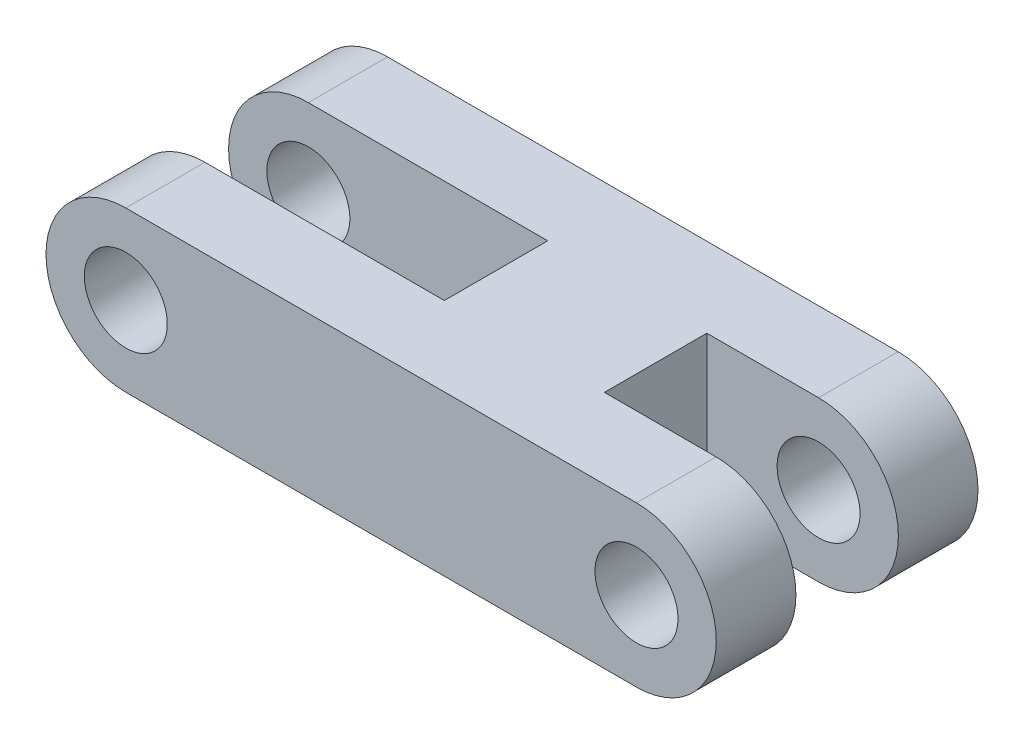
ISO-10303-21;
HEADER;
FILE_DESCRIPTION(('STEP AP214'),'2;1');
FILE_NAME('part.step','',(''),(''),'','','');
FILE_SCHEMA(('AUTOMOTIVE_DESIGN { 1 0 10303 214 1 1 1 1 }'));
ENDSEC;
DATA;
#1=APPLICATION_CONTEXT('core data for automotive mechanical design processes');
#2=APPLICATION_PROTOCOL_DEFINITION('international standard','automotive_design',2000,#1);
#3=PRODUCT_CONTEXT('',#1,'mechanical');
#4=PRODUCT('Part','Part','',(#3));
#5=PRODUCT_RELATED_PRODUCT_CATEGORY('part','',(#4));
#6=PRODUCT_DEFINITION_FORMATION('','',#4);
#7=PRODUCT_DEFINITION_CONTEXT('part definition',#1,'design');
#8=PRODUCT_DEFINITION('design','',#6,#7);
#9=PRODUCT_DEFINITION_SHAPE('','',#8);
#10=(LENGTH_UNIT() NAMED_UNIT(*) SI_UNIT(.MILLI.,.METRE.));
#11=(NAMED_UNIT(*) PLANE_ANGLE_UNIT() SI_UNIT($,.RADIAN.));
#12=(NAMED_UNIT(*) SI_UNIT($,.STERADIAN.) SOLID_ANGLE_UNIT());
#13=UNCERTAINTY_MEASURE_WITH_UNIT(LENGTH_MEASURE(1.E-05),#10,'distance_accuracy_value','');
#14=(GEOMETRIC_REPRESENTATION_CONTEXT(3) GLOBAL_UNCERTAINTY_ASSIGNED_CONTEXT((#13)) GLOBAL_UNIT_ASSIGNED_CONTEXT((#10,
#11,#12)) REPRESENTATION_CONTEXT('',''));
#15=CARTESIAN_POINT('',(0.,0.,0.));
#16=DIRECTION('',(0.,0.,1.));
#17=DIRECTION('',(1.,0.,0.));
#18=AXIS2_PLACEMENT_3D('',#15,#16,#17);
#19=CARTESIAN_POINT('',(-50.8588966961585,0.,10.414));
#20=DIRECTION('',(0.,0.,-1.));
#21=DIRECTION('',(-1.,0.,0.));
#22=AXIS2_PLACEMENT_3D('',#19,#20,#21);
#23=CYLINDRICAL_SURFACE('',#22,3.175);
#24=DIRECTION('',(0.,0.,-1.));
#25=VECTOR('',#24,1.);
#26=CARTESIAN_POINT('',(-50.8588966961585,3.17499999999999,10.414));
#27=LINE('',#26,#25);
#28=CARTESIAN_POINT('',(-50.8588966961585,3.17499999999999,3.16865));
#29=VERTEX_POINT('',#28);
#30=CARTESIAN_POINT('',(-50.8588966961585,3.17499999999999,0.));
#31=VERTEX_POINT('',#30);
#32=EDGE_CURVE('E223',#29,#31,#27,.T.);
#33=ORIENTED_EDGE('',*,*,#32,.F.);
#34=CARTESIAN_POINT('',(-50.8588966961585,0.,3.16865));
#35=DIRECTION('',(0.,0.,-1.));
#36=DIRECTION('',(-1.,0.,0.));
#37=AXIS2_PLACEMENT_3D('',#34,#35,#36);
#38=CIRCLE('',#37,3.175);
#39=CARTESIAN_POINT('',(-50.8588966961585,-3.17500000000001,3.16865));
#40=VERTEX_POINT('',#39);
#41=EDGE_CURVE('E156',#29,#40,#38,.T.);
#42=ORIENTED_EDGE('',*,*,#41,.T.);
#43=DIRECTION('',(0.,0.,-1.));
#44=VECTOR('',#43,1.);
#45=CARTESIAN_POINT('',(-50.8588966961586,-3.17500000000001,10.414));
#46=LINE('',#45,#44);
#47=CARTESIAN_POINT('',(-50.8588966961586,-3.17500000000001,0.));
#48=VERTEX_POINT('',#47);
#49=EDGE_CURVE('E227',#40,#48,#46,.T.);
#50=ORIENTED_EDGE('',*,*,#49,.T.);
#51=CARTESIAN_POINT('',(-50.8588966961585,0.,0.));
#52=DIRECTION('',(0.,0.,1.));
#53=DIRECTION('',(-1.,0.,0.));
#54=AXIS2_PLACEMENT_3D('',#51,#52,#53);
#55=CIRCLE('',#54,3.175);
#56=EDGE_CURVE('E215',#48,#31,#55,.T.);
#57=ORIENTED_EDGE('',*,*,#56,.T.);
#58=EDGE_LOOP('',(#33,#42,#50,#57));
#59=FACE_BOUND('',#58,.T.);
#60=ADVANCED_FACE('F33',(#59),#23,.T.);
#61=CARTESIAN_POINT('',(-50.8588966961585,0.,10.414));
#62=DIRECTION('',(0.,0.,-1.));
#63=DIRECTION('',(-1.,0.,0.));
#64=AXIS2_PLACEMENT_3D('',#61,#62,#63);
#65=CYLINDRICAL_SURFACE('',#64,1.651);
#66=CARTESIAN_POINT('',(-50.8588966961585,0.,3.16865));
#67=DIRECTION('',(0.,0.,-1.));
#68=DIRECTION('',(-1.,0.,0.));
#69=AXIS2_PLACEMENT_3D('',#66,#67,#68);
#70=CIRCLE('',#69,1.651);
#71=CARTESIAN_POINT('',(-52.5098966961585,0.,3.16865));
#72=VERTEX_POINT('',#71);
#73=EDGE_CURVE('E37',#72,#72,#70,.T.);
#74=ORIENTED_EDGE('',*,*,#73,.F.);
#75=EDGE_LOOP('',(#74));
#76=FACE_BOUND('',#75,.T.);
#77=CARTESIAN_POINT('',(-50.8588966961585,0.,0.));
#78=DIRECTION('',(0.,0.,1.));
#79=DIRECTION('',(1.,0.,0.));
#80=AXIS2_PLACEMENT_3D('',#77,#78,#79);
#81=CIRCLE('',#80,1.651);
#82=CARTESIAN_POINT('',(-49.2078966961585,0.,0.));
#83=VERTEX_POINT('',#82);
#84=EDGE_CURVE('E190',#83,#83,#81,.T.);
#85=ORIENTED_EDGE('',*,*,#84,.F.);
#86=EDGE_LOOP('',(#85));
#87=FACE_BOUND('',#86,.T.);
#88=ADVANCED_FACE('F243',(#76,#87),#65,.F.);
#89=CARTESIAN_POINT('',(-71.1788966961585,0.,10.414));
#90=DIRECTION('',(0.,0.,-1.));
#91=DIRECTION('',(-1.,0.,0.));
#92=AXIS2_PLACEMENT_3D('',#89,#90,#91);
#93=CYLINDRICAL_SURFACE('',#92,3.175);
#94=CARTESIAN_POINT('',(-71.1788966961585,0.,3.14960000000001));
#95=DIRECTION('',(0.,0.,-1.));
#96=DIRECTION('',(-1.,0.,0.));
#97=AXIS2_PLACEMENT_3D('',#94,#95,#96);
#98=CIRCLE('',#97,3.175);
#99=CARTESIAN_POINT('',(-71.1788966961585,-3.17500000000001,3.14960000000001));
#100=VERTEX_POINT('',#99);
#101=CARTESIAN_POINT('',(-71.1788966961585,3.17499999999999,3.14960000000001));
#102=VERTEX_POINT('',#101);
#103=EDGE_CURVE('E184',#100,#102,#98,.T.);
#104=ORIENTED_EDGE('',*,*,#103,.T.);
#105=DIRECTION('',(0.,0.,-1.));
#106=VECTOR('',#105,1.);
#107=CARTESIAN_POINT('',(-71.1788966961585,3.17499999999999,10.414));
#108=LINE('',#107,#106);
#109=CARTESIAN_POINT('',(-71.1788966961585,3.17499999999999,0.));
#110=VERTEX_POINT('',#109);
#111=EDGE_CURVE('E209',#102,#110,#108,.T.);
#112=ORIENTED_EDGE('',*,*,#111,.T.);
#113=CARTESIAN_POINT('',(-71.1788966961585,0.,0.));
#114=DIRECTION('',(0.,0.,1.));
#115=DIRECTION('',(1.,0.,0.));
#116=AXIS2_PLACEMENT_3D('',#113,#114,#115);
#117=CIRCLE('',#116,3.175);
#118=CARTESIAN_POINT('',(-71.1788966961585,-3.17500000000001,0.));
#119=VERTEX_POINT('',#118);
#120=EDGE_CURVE('E196',#110,#119,#117,.T.);
#121=ORIENTED_EDGE('',*,*,#120,.T.);
#122=DIRECTION('',(0.,0.,-1.));
#123=VECTOR('',#122,1.);
#124=CARTESIAN_POINT('',(-71.1788966961585,-3.17500000000001,10.414));
#125=LINE('',#124,#123);
#126=EDGE_CURVE('E42',#100,#119,#125,.T.);
#127=ORIENTED_EDGE('',*,*,#126,.F.);
#128=EDGE_LOOP('',(#104,#112,#121,#127));
#129=FACE_BOUND('',#128,.T.);
#130=ADVANCED_FACE('F270',(#129),#93,.T.);
#131=CARTESIAN_POINT('',(-71.1788966961585,0.,10.414));
#132=DIRECTION('',(0.,0.,-1.));
#133=DIRECTION('',(-1.,0.,0.));
#134=AXIS2_PLACEMENT_3D('',#131,#132,#133);
#135=CYLINDRICAL_SURFACE('',#134,1.65099999999999);
#136=CARTESIAN_POINT('',(-71.1788966961585,0.,3.14960000000001));
#137=DIRECTION('',(0.,0.,-1.));
#138=DIRECTION('',(-1.,0.,0.));
#139=AXIS2_PLACEMENT_3D('',#136,#137,#138);
#140=CIRCLE('',#139,1.65099999999999);
#141=CARTESIAN_POINT('',(-72.8298966961585,0.,3.14960000000001));
#142=VERTEX_POINT('',#141);
#143=EDGE_CURVE('E183',#142,#142,#140,.T.);
#144=ORIENTED_EDGE('',*,*,#143,.F.);
#145=EDGE_LOOP('',(#144));
#146=FACE_BOUND('',#145,.T.);
#147=CARTESIAN_POINT('',(-71.1788966961585,0.,0.));
#148=DIRECTION('',(0.,0.,1.));
#149=DIRECTION('',(-1.,0.,0.));
#150=AXIS2_PLACEMENT_3D('',#147,#148,#149);
#151=CIRCLE('',#150,1.65099999999999);
#152=CARTESIAN_POINT('',(-72.8298966961585,0.,0.));
#153=VERTEX_POINT('',#152);
#154=EDGE_CURVE('E186',#153,#153,#151,.T.);
#155=ORIENTED_EDGE('',*,*,#154,.F.);
#156=EDGE_LOOP('',(#155));
#157=FACE_BOUND('',#156,.T.);
#158=ADVANCED_FACE('F250',(#146,#157),#135,.F.);
#159=CARTESIAN_POINT('',(-71.1788966961585,0.,10.414));
#160=DIRECTION('',(0.,0.,1.));
#161=DIRECTION('',(1.,0.,0.));
#162=AXIS2_PLACEMENT_3D('',#159,#160,#161);
#163=PLANE('',#162);
#164=CARTESIAN_POINT('',(-50.8588966961585,0.,10.414));
#165=DIRECTION('',(0.,0.,1.));
#166=DIRECTION('',(1.,0.,0.));
#167=AXIS2_PLACEMENT_3D('',#164,#165,#166);
#168=CIRCLE('',#167,1.651);
#169=CARTESIAN_POINT('',(-49.2078966961585,0.,10.414));
#170=VERTEX_POINT('',#169);
#171=EDGE_CURVE('E193',#170,#170,#168,.T.);
#172=ORIENTED_EDGE('',*,*,#171,.F.);
#173=EDGE_LOOP('',(#172));
#174=FACE_BOUND('',#173,.T.);
#175=CARTESIAN_POINT('',(-71.1788966961585,0.,10.414));
#176=DIRECTION('',(0.,0.,1.));
#177=DIRECTION('',(1.,0.,0.));
#178=AXIS2_PLACEMENT_3D('',#175,#176,#177);
#179=CIRCLE('',#178,3.175);
#180=CARTESIAN_POINT('',(-71.1788966961585,3.17499999999999,10.414));
#181=VERTEX_POINT('',#180);
#182=CARTESIAN_POINT('',(-71.1788966961585,-3.17500000000001,10.414));
#183=VERTEX_POINT('',#182);
#184=EDGE_CURVE('E199',#181,#183,#179,.T.);
#185=ORIENTED_EDGE('',*,*,#184,.T.);
#186=DIRECTION('',(1.,0.,0.));
#187=VECTOR('',#186,1.);
#188=CARTESIAN_POINT('',(-71.1788966961585,-3.17500000000001,10.414));
#189=LINE('',#188,#187);
#190=CARTESIAN_POINT('',(-50.8588966961586,-3.17500000000001,10.414));
#191=VERTEX_POINT('',#190);
#192=EDGE_CURVE('E202',#183,#191,#189,.T.);
#193=ORIENTED_EDGE('',*,*,#192,.T.);
#194=CARTESIAN_POINT('',(-50.8588966961585,0.,10.414));
#195=DIRECTION('',(0.,0.,1.));
#196=DIRECTION('',(-1.,0.,0.));
#197=AXIS2_PLACEMENT_3D('',#194,#195,#196);
#198=CIRCLE('',#197,3.175);
#199=CARTESIAN_POINT('',(-50.8588966961585,3.17499999999999,10.414));
#200=VERTEX_POINT('',#199);
#201=EDGE_CURVE('E205',#191,#200,#198,.T.);
#202=ORIENTED_EDGE('',*,*,#201,.T.);
#203=DIRECTION('',(-1.,0.,0.));
#204=VECTOR('',#203,1.);
#205=CARTESIAN_POINT('',(-71.1788966961585,3.17499999999999,10.414));
#206=LINE('',#205,#204);
#207=EDGE_CURVE('E207',#200,#181,#206,.T.);
#208=ORIENTED_EDGE('',*,*,#207,.T.);
#209=EDGE_LOOP('',(#185,#193,#202,#208));
#210=FACE_BOUND('',#209,.T.);
#211=CARTESIAN_POINT('',(-71.1788966961585,0.,10.414));
#212=DIRECTION('',(0.,0.,1.));
#213=DIRECTION('',(-1.,0.,0.));
#214=AXIS2_PLACEMENT_3D('',#211,#212,#213);
#215=CIRCLE('',#214,1.65099999999999);
#216=CARTESIAN_POINT('',(-72.8298966961585,0.,10.414));
#217=VERTEX_POINT('',#216);
#218=EDGE_CURVE('E187',#217,#217,#215,.T.);
#219=ORIENTED_EDGE('',*,*,#218,.F.);
#220=EDGE_LOOP('',(#219));
#221=FACE_BOUND('',#220,.T.);
#222=ADVANCED_FACE('F246',(#174,#210,#221),#163,.T.);
#223=CARTESIAN_POINT('',(-71.1788966961585,0.,0.));
#224=DIRECTION('',(0.,0.,1.));
#225=DIRECTION('',(1.,0.,0.));
#226=AXIS2_PLACEMENT_3D('',#223,#224,#225);
#227=PLANE('',#226);
#228=ORIENTED_EDGE('',*,*,#84,.T.);
#229=EDGE_LOOP('',(#228));
#230=FACE_BOUND('',#229,.T.);
#231=ORIENTED_EDGE('',*,*,#120,.F.);
#232=DIRECTION('',(-1.,0.,0.));
#233=VECTOR('',#232,1.);
#234=CARTESIAN_POINT('',(-71.1788966961585,3.17499999999999,0.));
#235=LINE('',#234,#233);
#236=EDGE_CURVE('E203',#31,#110,#235,.T.);
#237=ORIENTED_EDGE('',*,*,#236,.F.);
#238=ORIENTED_EDGE('',*,*,#56,.F.);
#239=DIRECTION('',(1.,0.,0.));
#240=VECTOR('',#239,1.);
#241=CARTESIAN_POINT('',(-71.1788966961585,-3.17500000000001,0.));
#242=LINE('',#241,#240);
#243=EDGE_CURVE('E212',#119,#48,#242,.T.);
#244=ORIENTED_EDGE('',*,*,#243,.F.);
#245=EDGE_LOOP('',(#231,#237,#238,#244));
#246=FACE_BOUND('',#245,.T.);
#247=ORIENTED_EDGE('',*,*,#154,.T.);
#248=EDGE_LOOP('',(#247));
#249=FACE_BOUND('',#248,.T.);
#250=ADVANCED_FACE('F249',(#230,#246,#249),#227,.F.);
#251=CARTESIAN_POINT('',(-71.1788966961585,3.17499999999999,7.26440000000001));
#252=VERTEX_POINT('',#251);
#253=EDGE_CURVE('E220',#181,#252,#108,.T.);
#254=ORIENTED_EDGE('',*,*,#253,.T.);
#255=CARTESIAN_POINT('',(-71.1788966961585,0.,7.26440000000001));
#256=DIRECTION('',(0.,0.,1.));
#257=DIRECTION('',(1.,0.,0.));
#258=AXIS2_PLACEMENT_3D('',#255,#256,#257);
#259=CIRCLE('',#258,3.175);
#260=CARTESIAN_POINT('',(-71.1788966961585,-3.17500000000001,7.26440000000001));
#261=VERTEX_POINT('',#260);
#262=EDGE_CURVE('E58',#252,#261,#259,.T.);
#263=ORIENTED_EDGE('',*,*,#262,.T.);
#264=EDGE_CURVE('E11',#183,#261,#125,.T.);
#265=ORIENTED_EDGE('',*,*,#264,.F.);
#266=ORIENTED_EDGE('',*,*,#184,.F.);
#267=EDGE_LOOP('',(#254,#263,#265,#266));
#268=FACE_BOUND('',#267,.T.);
#269=ADVANCED_FACE('F35',(#268),#93,.T.);
#270=CARTESIAN_POINT('',(-71.1788966961585,-3.17500000000001,10.414));
#271=DIRECTION('',(0.,1.,0.));
#272=DIRECTION('',(-1.,0.,0.));
#273=AXIS2_PLACEMENT_3D('',#270,#271,#272);
#274=PLANE('',#273);
#275=ORIENTED_EDGE('',*,*,#49,.F.);
#276=DIRECTION('',(-1.,0.,0.));
#277=VECTOR('',#276,1.);
#278=CARTESIAN_POINT('',(-55.3038966961586,-3.17500000000001,3.16865));
#279=LINE('',#278,#277);
#280=CARTESIAN_POINT('',(-55.3038966961586,-3.17500000000001,3.16865));
#281=VERTEX_POINT('',#280);
#282=EDGE_CURVE('E132',#40,#281,#279,.T.);
#283=ORIENTED_EDGE('',*,*,#282,.T.);
#284=DIRECTION('',(0.,0.,1.));
#285=VECTOR('',#284,1.);
#286=CARTESIAN_POINT('',(-55.3038966961586,-3.17500000000001,7.24535));
#287=LINE('',#286,#285);
#288=CARTESIAN_POINT('',(-55.3038966961586,-3.17500000000001,7.24535));
#289=VERTEX_POINT('',#288);
#290=EDGE_CURVE('E127',#281,#289,#287,.T.);
#291=ORIENTED_EDGE('',*,*,#290,.T.);
#292=DIRECTION('',(1.,0.,0.));
#293=VECTOR('',#292,1.);
#294=CARTESIAN_POINT('',(-55.3038966961586,-3.17500000000001,7.24535));
#295=LINE('',#294,#293);
#296=CARTESIAN_POINT('',(-50.8588966961585,-3.17500000000001,7.24535));
#297=VERTEX_POINT('',#296);
#298=EDGE_CURVE('E135',#289,#297,#295,.T.);
#299=ORIENTED_EDGE('',*,*,#298,.T.);
#300=EDGE_CURVE('E228',#191,#297,#46,.T.);
#301=ORIENTED_EDGE('',*,*,#300,.F.);
#302=ORIENTED_EDGE('',*,*,#192,.F.);
#303=ORIENTED_EDGE('',*,*,#264,.T.);
#304=DIRECTION('',(1.,0.,0.));
#305=VECTOR('',#304,1.);
#306=CARTESIAN_POINT('',(-61.6538966961585,-3.17500000000001,7.26440000000001));
#307=LINE('',#306,#305);
#308=CARTESIAN_POINT('',(-61.6538966961585,-3.17500000000001,7.26440000000001));
#309=VERTEX_POINT('',#308);
#310=EDGE_CURVE('E160',#261,#309,#307,.T.);
#311=ORIENTED_EDGE('',*,*,#310,.T.);
#312=DIRECTION('',(0.,0.,-1.));
#313=VECTOR('',#312,1.);
#314=CARTESIAN_POINT('',(-61.6538966961585,-3.17500000000001,7.26440000000001));
#315=LINE('',#314,#313);
#316=CARTESIAN_POINT('',(-61.6538966961585,-3.17500000000001,3.1496));
#317=VERTEX_POINT('',#316);
#318=EDGE_CURVE('E163',#309,#317,#315,.T.);
#319=ORIENTED_EDGE('',*,*,#318,.T.);
#320=DIRECTION('',(-1.,0.,0.));
#321=VECTOR('',#320,1.);
#322=CARTESIAN_POINT('',(-61.6538966961585,-3.17500000000001,3.1496));
#323=LINE('',#322,#321);
#324=EDGE_CURVE('E167',#317,#100,#323,.T.);
#325=ORIENTED_EDGE('',*,*,#324,.T.);
#326=ORIENTED_EDGE('',*,*,#126,.T.);
#327=ORIENTED_EDGE('',*,*,#243,.T.);
#328=EDGE_LOOP('',(#275,#283,#291,#299,#301,#302,#303,#311,#319,#325,#326,#327));
#329=FACE_BOUND('',#328,.T.);
#330=ADVANCED_FACE('F144',(#329),#274,.F.);
#331=ORIENTED_EDGE('',*,*,#300,.T.);
#332=CARTESIAN_POINT('',(-50.8588966961585,0.,7.24535));
#333=DIRECTION('',(0.,0.,1.));
#334=DIRECTION('',(1.,0.,0.));
#335=AXIS2_PLACEMENT_3D('',#332,#333,#334);
#336=CIRCLE('',#335,3.175);
#337=CARTESIAN_POINT('',(-50.8588966961585,3.17499999999999,7.24535));
#338=VERTEX_POINT('',#337);
#339=EDGE_CURVE('E138',#297,#338,#336,.T.);
#340=ORIENTED_EDGE('',*,*,#339,.T.);
#341=EDGE_CURVE('E224',#200,#338,#27,.T.);
#342=ORIENTED_EDGE('',*,*,#341,.F.);
#343=ORIENTED_EDGE('',*,*,#201,.F.);
#344=EDGE_LOOP('',(#331,#340,#342,#343));
#345=FACE_BOUND('',#344,.T.);
#346=ADVANCED_FACE('F275',(#345),#23,.T.);
#347=CARTESIAN_POINT('',(-71.1788966961585,3.17499999999999,10.414));
#348=DIRECTION('',(0.,-1.,0.));
#349=DIRECTION('',(1.,0.,0.));
#350=AXIS2_PLACEMENT_3D('',#347,#348,#349);
#351=PLANE('',#350);
#352=DIRECTION('',(0.,0.,1.));
#353=VECTOR('',#352,1.);
#354=CARTESIAN_POINT('',(-55.3038966961586,3.17499999999999,7.24535));
#355=LINE('',#354,#353);
#356=CARTESIAN_POINT('',(-55.3038966961586,3.17499999999999,3.16865));
#357=VERTEX_POINT('',#356);
#358=CARTESIAN_POINT('',(-55.3038966961586,3.17499999999999,7.24535));
#359=VERTEX_POINT('',#358);
#360=EDGE_CURVE('E50',#357,#359,#355,.T.);
#361=ORIENTED_EDGE('',*,*,#360,.F.);
#362=DIRECTION('',(-1.,0.,0.));
#363=VECTOR('',#362,1.);
#364=CARTESIAN_POINT('',(-55.3038966961586,3.17499999999999,3.16865));
#365=LINE('',#364,#363);
#366=EDGE_CURVE('E145',#29,#357,#365,.T.);
#367=ORIENTED_EDGE('',*,*,#366,.F.);
#368=ORIENTED_EDGE('',*,*,#32,.T.);
#369=ORIENTED_EDGE('',*,*,#236,.T.);
#370=ORIENTED_EDGE('',*,*,#111,.F.);
#371=DIRECTION('',(-1.,0.,0.));
#372=VECTOR('',#371,1.);
#373=CARTESIAN_POINT('',(-61.6538966961585,3.17499999999999,3.1496));
#374=LINE('',#373,#372);
#375=CARTESIAN_POINT('',(-61.6538966961585,3.17499999999999,3.1496));
#376=VERTEX_POINT('',#375);
#377=EDGE_CURVE('E164',#376,#102,#374,.T.);
#378=ORIENTED_EDGE('',*,*,#377,.F.);
#379=DIRECTION('',(0.,0.,-1.));
#380=VECTOR('',#379,1.);
#381=CARTESIAN_POINT('',(-61.6538966961585,3.17499999999999,7.26440000000001));
#382=LINE('',#381,#380);
#383=CARTESIAN_POINT('',(-61.6538966961585,3.17499999999999,7.26440000000001));
#384=VERTEX_POINT('',#383);
#385=EDGE_CURVE('E172',#384,#376,#382,.T.);
#386=ORIENTED_EDGE('',*,*,#385,.F.);
#387=DIRECTION('',(1.,0.,0.));
#388=VECTOR('',#387,1.);
#389=CARTESIAN_POINT('',(-61.6538966961585,3.17499999999999,7.26440000000001));
#390=LINE('',#389,#388);
#391=EDGE_CURVE('E159',#252,#384,#390,.T.);
#392=ORIENTED_EDGE('',*,*,#391,.F.);
#393=ORIENTED_EDGE('',*,*,#253,.F.);
#394=ORIENTED_EDGE('',*,*,#207,.F.);
#395=ORIENTED_EDGE('',*,*,#341,.T.);
#396=DIRECTION('',(1.,0.,0.));
#397=VECTOR('',#396,1.);
#398=CARTESIAN_POINT('',(-55.3038966961586,3.17499999999999,7.24535));
#399=LINE('',#398,#397);
#400=EDGE_CURVE('E147',#359,#338,#399,.T.);
#401=ORIENTED_EDGE('',*,*,#400,.F.);
#402=EDGE_LOOP('',(#361,#367,#368,#369,#370,#378,#386,#392,#393,#394,#395,#401));
#403=FACE_BOUND('',#402,.T.);
#404=ADVANCED_FACE('F241',(#403),#351,.F.);
#405=CARTESIAN_POINT('',(-50.8588966961585,0.,7.24535));
#406=DIRECTION('',(0.,0.,1.));
#407=DIRECTION('',(1.,0.,0.));
#408=AXIS2_PLACEMENT_3D('',#405,#406,#407);
#409=CIRCLE('',#408,1.651);
#410=CARTESIAN_POINT('',(-49.2078966961585,0.,7.24535));
#411=VERTEX_POINT('',#410);
#412=EDGE_CURVE('E153',#411,#411,#409,.T.);
#413=ORIENTED_EDGE('',*,*,#412,.F.);
#414=EDGE_LOOP('',(#413));
#415=FACE_BOUND('',#414,.T.);
#416=ORIENTED_EDGE('',*,*,#171,.T.);
#417=EDGE_LOOP('',(#416));
#418=FACE_BOUND('',#417,.T.);
#419=ADVANCED_FACE('F237',(#415,#418),#65,.F.);
#420=CARTESIAN_POINT('',(-71.1788966961585,0.,7.26440000000001));
#421=DIRECTION('',(0.,0.,1.));
#422=DIRECTION('',(1.,0.,0.));
#423=AXIS2_PLACEMENT_3D('',#420,#421,#422);
#424=CIRCLE('',#423,1.65099999999999);
#425=CARTESIAN_POINT('',(-69.5278966961586,0.,7.26440000000001));
#426=VERTEX_POINT('',#425);
#427=EDGE_CURVE('E179',#426,#426,#424,.T.);
#428=ORIENTED_EDGE('',*,*,#427,.F.);
#429=EDGE_LOOP('',(#428));
#430=FACE_BOUND('',#429,.T.);
#431=ORIENTED_EDGE('',*,*,#218,.T.);
#432=EDGE_LOOP('',(#431));
#433=FACE_BOUND('',#432,.T.);
#434=ADVANCED_FACE('F240',(#430,#433),#135,.F.);
#435=CARTESIAN_POINT('',(-61.6538966961585,-3.17500000000001,3.1496));
#436=DIRECTION('',(0.,0.,-1.));
#437=DIRECTION('',(-1.,0.,0.));
#438=AXIS2_PLACEMENT_3D('',#435,#436,#437);
#439=PLANE('',#438);
#440=ORIENTED_EDGE('',*,*,#143,.T.);
#441=EDGE_LOOP('',(#440));
#442=FACE_BOUND('',#441,.T.);
#443=ORIENTED_EDGE('',*,*,#103,.F.);
#444=ORIENTED_EDGE('',*,*,#324,.F.);
#445=DIRECTION('',(0.,1.,0.));
#446=VECTOR('',#445,1.);
#447=CARTESIAN_POINT('',(-61.6538966961585,-3.17500000000001,3.1496));
#448=LINE('',#447,#446);
#449=EDGE_CURVE('E177',#317,#376,#448,.T.);
#450=ORIENTED_EDGE('',*,*,#449,.T.);
#451=ORIENTED_EDGE('',*,*,#377,.T.);
#452=EDGE_LOOP('',(#443,#444,#450,#451));
#453=FACE_BOUND('',#452,.T.);
#454=ADVANCED_FACE('F258',(#442,#453),#439,.F.);
#455=CARTESIAN_POINT('',(-61.6538966961585,-3.17500000000001,7.26440000000001));
#456=DIRECTION('',(0.,0.,1.));
#457=DIRECTION('',(1.,0.,0.));
#458=AXIS2_PLACEMENT_3D('',#455,#456,#457);
#459=PLANE('',#458);
#460=ORIENTED_EDGE('',*,*,#427,.T.);
#461=EDGE_LOOP('',(#460));
#462=FACE_BOUND('',#461,.T.);
#463=ORIENTED_EDGE('',*,*,#391,.T.);
#464=DIRECTION('',(0.,1.,0.));
#465=VECTOR('',#464,1.);
#466=CARTESIAN_POINT('',(-61.6538966961585,-3.17500000000001,7.26440000000001));
#467=LINE('',#466,#465);
#468=EDGE_CURVE('E170',#309,#384,#467,.T.);
#469=ORIENTED_EDGE('',*,*,#468,.F.);
#470=ORIENTED_EDGE('',*,*,#310,.F.);
#471=ORIENTED_EDGE('',*,*,#262,.F.);
#472=EDGE_LOOP('',(#463,#469,#470,#471));
#473=FACE_BOUND('',#472,.T.);
#474=ADVANCED_FACE('F264',(#462,#473),#459,.F.);
#475=CARTESIAN_POINT('',(-61.6538966961585,-3.17500000000001,7.26440000000001));
#476=DIRECTION('',(1.,0.,0.));
#477=DIRECTION('',(0.,1.,0.));
#478=AXIS2_PLACEMENT_3D('',#475,#476,#477);
#479=PLANE('',#478);
#480=ORIENTED_EDGE('',*,*,#385,.T.);
#481=ORIENTED_EDGE('',*,*,#449,.F.);
#482=ORIENTED_EDGE('',*,*,#318,.F.);
#483=ORIENTED_EDGE('',*,*,#468,.T.);
#484=EDGE_LOOP('',(#480,#481,#482,#483));
#485=FACE_BOUND('',#484,.T.);
#486=ADVANCED_FACE('F299',(#485),#479,.F.);
#487=CARTESIAN_POINT('',(-55.3038966961586,-3.17500000000001,3.16865));
#488=DIRECTION('',(0.,0.,-1.));
#489=DIRECTION('',(-1.,0.,0.));
#490=AXIS2_PLACEMENT_3D('',#487,#488,#489);
#491=PLANE('',#490);
#492=ORIENTED_EDGE('',*,*,#73,.T.);
#493=EDGE_LOOP('',(#492));
#494=FACE_BOUND('',#493,.T.);
#495=ORIENTED_EDGE('',*,*,#366,.T.);
#496=DIRECTION('',(0.,1.,0.));
#497=VECTOR('',#496,1.);
#498=CARTESIAN_POINT('',(-55.3038966961586,-3.17500000000001,3.16865));
#499=LINE('',#498,#497);
#500=EDGE_CURVE('E131',#281,#357,#499,.T.);
#501=ORIENTED_EDGE('',*,*,#500,.F.);
#502=ORIENTED_EDGE('',*,*,#282,.F.);
#503=ORIENTED_EDGE('',*,*,#41,.F.);
#504=EDGE_LOOP('',(#495,#501,#502,#503));
#505=FACE_BOUND('',#504,.T.);
#506=ADVANCED_FACE('F312',(#494,#505),#491,.F.);
#507=CARTESIAN_POINT('',(-55.3038966961586,-3.17500000000001,7.24535));
#508=DIRECTION('',(0.,0.,1.));
#509=DIRECTION('',(1.,0.,0.));
#510=AXIS2_PLACEMENT_3D('',#507,#508,#509);
#511=PLANE('',#510);
#512=ORIENTED_EDGE('',*,*,#412,.T.);
#513=EDGE_LOOP('',(#512));
#514=FACE_BOUND('',#513,.T.);
#515=ORIENTED_EDGE('',*,*,#298,.F.);
#516=DIRECTION('',(0.,1.,0.));
#517=VECTOR('',#516,1.);
#518=CARTESIAN_POINT('',(-55.3038966961586,-3.17500000000001,7.24535));
#519=LINE('',#518,#517);
#520=EDGE_CURVE('E123',#289,#359,#519,.T.);
#521=ORIENTED_EDGE('',*,*,#520,.T.);
#522=ORIENTED_EDGE('',*,*,#400,.T.);
#523=ORIENTED_EDGE('',*,*,#339,.F.);
#524=EDGE_LOOP('',(#515,#521,#522,#523));
#525=FACE_BOUND('',#524,.T.);
#526=ADVANCED_FACE('F136',(#514,#525),#511,.F.);
#527=CARTESIAN_POINT('',(-55.3038966961586,-3.17500000000001,7.24535));
#528=DIRECTION('',(-1.,0.,0.));
#529=DIRECTION('',(0.,-1.,0.));
#530=AXIS2_PLACEMENT_3D('',#527,#528,#529);
#531=PLANE('',#530);
#532=ORIENTED_EDGE('',*,*,#360,.T.);
#533=ORIENTED_EDGE('',*,*,#520,.F.);
#534=ORIENTED_EDGE('',*,*,#290,.F.);
#535=ORIENTED_EDGE('',*,*,#500,.T.);
#536=EDGE_LOOP('',(#532,#533,#534,#535));
#537=FACE_BOUND('',#536,.T.);
#538=ADVANCED_FACE('F125',(#537),#531,.F.);
#539=CLOSED_SHELL('',(#60,#88,#130,#158,#222,#250,#269,#330,#346,#404,#419,#434,#454,#474,#486,
#506,#526,#538));
#540=MANIFOLD_SOLID_BREP('B2',#539);
#541=ADVANCED_BREP_SHAPE_REPRESENTATION('',(#18,#540),#14);
#542=SHAPE_DEFINITION_REPRESENTATION(#9,#541);
ENDSEC;
END-ISO-10303-21;
